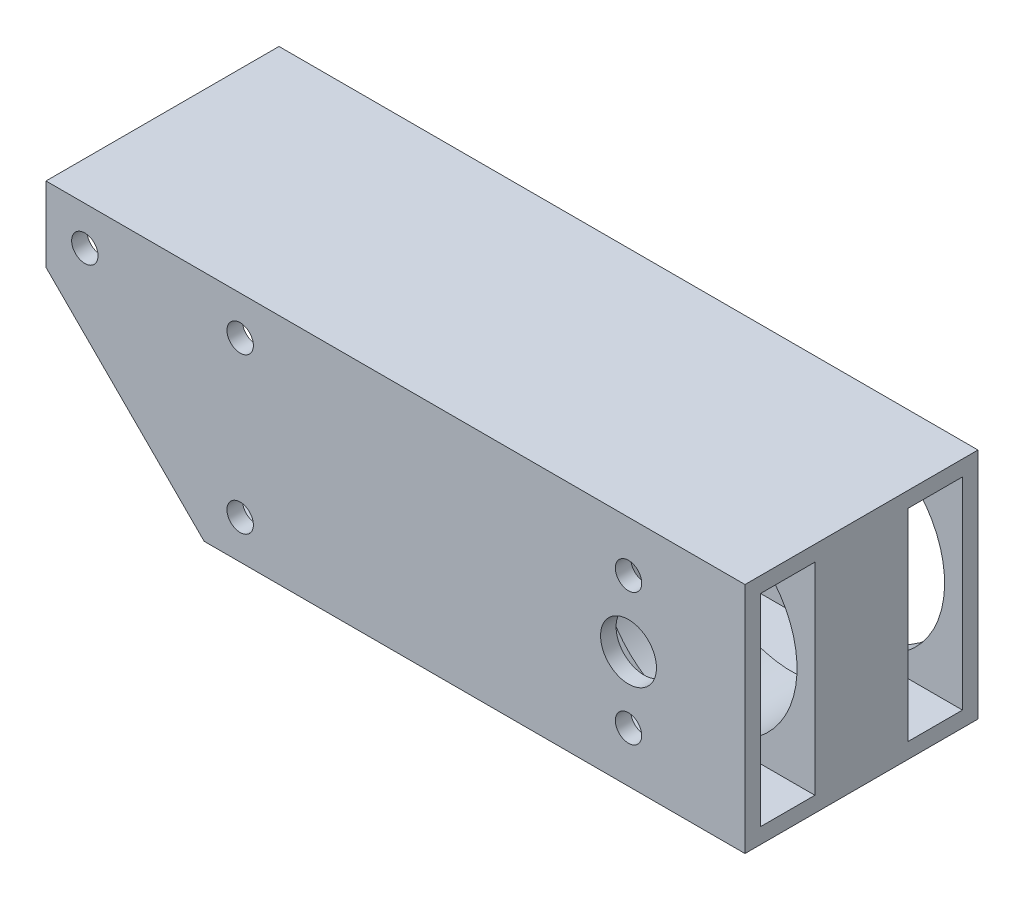
ISO-10303-21;
HEADER;
FILE_DESCRIPTION(('STEP AP214'),'2;1');
FILE_NAME('part.step','',(''),(''),'','','');
FILE_SCHEMA(('AUTOMOTIVE_DESIGN { 1 0 10303 214 1 1 1 1 }'));
ENDSEC;
DATA;
#1=APPLICATION_CONTEXT('core data for automotive mechanical design processes');
#2=APPLICATION_PROTOCOL_DEFINITION('international standard','automotive_design',2000,#1);
#3=PRODUCT_CONTEXT('',#1,'mechanical');
#4=PRODUCT('Part','Part','',(#3));
#5=PRODUCT_RELATED_PRODUCT_CATEGORY('part','',(#4));
#6=PRODUCT_DEFINITION_FORMATION('','',#4);
#7=PRODUCT_DEFINITION_CONTEXT('part definition',#1,'design');
#8=PRODUCT_DEFINITION('design','',#6,#7);
#9=PRODUCT_DEFINITION_SHAPE('','',#8);
#10=(LENGTH_UNIT() NAMED_UNIT(*) SI_UNIT(.MILLI.,.METRE.));
#11=(NAMED_UNIT(*) PLANE_ANGLE_UNIT() SI_UNIT($,.RADIAN.));
#12=(NAMED_UNIT(*) SI_UNIT($,.STERADIAN.) SOLID_ANGLE_UNIT());
#13=UNCERTAINTY_MEASURE_WITH_UNIT(LENGTH_MEASURE(1.E-05),#10,'distance_accuracy_value','');
#14=(GEOMETRIC_REPRESENTATION_CONTEXT(3) GLOBAL_UNCERTAINTY_ASSIGNED_CONTEXT((#13)) GLOBAL_UNIT_ASSIGNED_CONTEXT((#10,
#11,#12)) REPRESENTATION_CONTEXT('',''));
#15=CARTESIAN_POINT('',(0.,0.,0.));
#16=DIRECTION('',(0.,0.,1.));
#17=DIRECTION('',(1.,0.,0.));
#18=AXIS2_PLACEMENT_3D('',#15,#16,#17);
#19=CARTESIAN_POINT('',(90.,13.,6.));
#20=DIRECTION('',(0.,0.,1.));
#21=DIRECTION('',(0.,-1.,0.));
#22=AXIS2_PLACEMENT_3D('',#19,#20,#21);
#23=PLANE('',#22);
#24=CARTESIAN_POINT('',(75.,0.,6.));
#25=DIRECTION('',(0.,0.,1.));
#26=DIRECTION('',(0.,-1.,0.));
#27=AXIS2_PLACEMENT_3D('',#24,#25,#26);
#28=CIRCLE('',#27,12.7);
#29=CARTESIAN_POINT('',(75.,-12.7,6.));
#30=VERTEX_POINT('',#29);
#31=EDGE_CURVE('E285',#30,#30,#28,.T.);
#32=ORIENTED_EDGE('',*,*,#31,.F.);
#33=EDGE_LOOP('',(#32));
#34=FACE_BOUND('',#33,.T.);
#35=DIRECTION('',(-1.,0.,0.));
#36=VECTOR('',#35,1.);
#37=CARTESIAN_POINT('',(90.,13.,6.));
#38=LINE('',#37,#36);
#39=CARTESIAN_POINT('',(90.,13.,6.));
#40=VERTEX_POINT('',#39);
#41=CARTESIAN_POINT('',(59.,13.,6.));
#42=VERTEX_POINT('',#41);
#43=EDGE_CURVE('E343',#40,#42,#38,.T.);
#44=ORIENTED_EDGE('',*,*,#43,.T.);
#45=DIRECTION('',(0.,1.,0.));
#46=VECTOR('',#45,1.);
#47=CARTESIAN_POINT('',(59.,13.,6.));
#48=LINE('',#47,#46);
#49=CARTESIAN_POINT('',(59.,-13.,6.));
#50=VERTEX_POINT('',#49);
#51=EDGE_CURVE('E262',#50,#42,#48,.T.);
#52=ORIENTED_EDGE('',*,*,#51,.F.);
#53=DIRECTION('',(-1.,0.,0.));
#54=VECTOR('',#53,1.);
#55=CARTESIAN_POINT('',(90.,-13.,6.));
#56=LINE('',#55,#54);
#57=CARTESIAN_POINT('',(90.,-13.,6.));
#58=VERTEX_POINT('',#57);
#59=EDGE_CURVE('E347',#58,#50,#56,.T.);
#60=ORIENTED_EDGE('',*,*,#59,.F.);
#61=DIRECTION('',(0.,1.,0.));
#62=VECTOR('',#61,1.);
#63=CARTESIAN_POINT('',(90.,13.,6.));
#64=LINE('',#63,#62);
#65=EDGE_CURVE('E328',#58,#40,#64,.T.);
#66=ORIENTED_EDGE('',*,*,#65,.T.);
#67=EDGE_LOOP('',(#44,#52,#60,#66));
#68=FACE_BOUND('',#67,.T.);
#69=ADVANCED_FACE('F45',(#34,#68),#23,.T.);
#70=CARTESIAN_POINT('',(90.,13.,-6.));
#71=DIRECTION('',(0.,0.,-1.));
#72=DIRECTION('',(0.,1.,0.));
#73=AXIS2_PLACEMENT_3D('',#70,#71,#72);
#74=PLANE('',#73);
#75=CARTESIAN_POINT('',(75.,0.,-6.));
#76=DIRECTION('',(0.,0.,-1.));
#77=DIRECTION('',(0.,1.,0.));
#78=AXIS2_PLACEMENT_3D('',#75,#76,#77);
#79=CIRCLE('',#78,12.7);
#80=CARTESIAN_POINT('',(75.,12.7,-6.));
#81=VERTEX_POINT('',#80);
#82=EDGE_CURVE('E201',#81,#81,#79,.T.);
#83=ORIENTED_EDGE('',*,*,#82,.F.);
#84=EDGE_LOOP('',(#83));
#85=FACE_BOUND('',#84,.T.);
#86=DIRECTION('',(-1.,0.,0.));
#87=VECTOR('',#86,1.);
#88=CARTESIAN_POINT('',(90.,-13.,-6.));
#89=LINE('',#88,#87);
#90=CARTESIAN_POINT('',(90.,-13.,-6.));
#91=VERTEX_POINT('',#90);
#92=CARTESIAN_POINT('',(59.,-13.,-6.));
#93=VERTEX_POINT('',#92);
#94=EDGE_CURVE('E309',#91,#93,#89,.T.);
#95=ORIENTED_EDGE('',*,*,#94,.T.);
#96=DIRECTION('',(0.,-1.,0.));
#97=VECTOR('',#96,1.);
#98=CARTESIAN_POINT('',(59.,13.,-6.));
#99=LINE('',#98,#97);
#100=CARTESIAN_POINT('',(59.,13.,-6.));
#101=VERTEX_POINT('',#100);
#102=EDGE_CURVE('E68',#101,#93,#99,.T.);
#103=ORIENTED_EDGE('',*,*,#102,.F.);
#104=DIRECTION('',(-1.,0.,0.));
#105=VECTOR('',#104,1.);
#106=CARTESIAN_POINT('',(90.,13.,-6.));
#107=LINE('',#106,#105);
#108=CARTESIAN_POINT('',(90.,13.,-6.));
#109=VERTEX_POINT('',#108);
#110=EDGE_CURVE('E313',#109,#101,#107,.T.);
#111=ORIENTED_EDGE('',*,*,#110,.F.);
#112=DIRECTION('',(0.,-1.,0.));
#113=VECTOR('',#112,1.);
#114=CARTESIAN_POINT('',(90.,13.,-6.));
#115=LINE('',#114,#113);
#116=EDGE_CURVE('E296',#109,#91,#115,.T.);
#117=ORIENTED_EDGE('',*,*,#116,.T.);
#118=EDGE_LOOP('',(#95,#103,#111,#117));
#119=FACE_BOUND('',#118,.T.);
#120=ADVANCED_FACE('F439',(#85,#119),#74,.T.);
#121=CARTESIAN_POINT('',(90.,0.,0.));
#122=DIRECTION('',(-1.,0.,0.));
#123=DIRECTION('',(0.,0.,1.));
#124=AXIS2_PLACEMENT_3D('',#121,#122,#123);
#125=PLANE('',#124);
#126=DIRECTION('',(0.,-1.,0.));
#127=VECTOR('',#126,1.);
#128=CARTESIAN_POINT('',(90.,13.,13.));
#129=LINE('',#128,#127);
#130=CARTESIAN_POINT('',(90.,13.,13.));
#131=VERTEX_POINT('',#130);
#132=CARTESIAN_POINT('',(90.,-13.,13.));
#133=VERTEX_POINT('',#132);
#134=EDGE_CURVE('E321',#131,#133,#129,.T.);
#135=ORIENTED_EDGE('',*,*,#134,.F.);
#136=DIRECTION('',(0.,0.,1.));
#137=VECTOR('',#136,1.);
#138=CARTESIAN_POINT('',(90.,13.,13.));
#139=LINE('',#138,#137);
#140=EDGE_CURVE('E332',#40,#131,#139,.T.);
#141=ORIENTED_EDGE('',*,*,#140,.F.);
#142=ORIENTED_EDGE('',*,*,#65,.F.);
#143=DIRECTION('',(0.,0.,-1.));
#144=VECTOR('',#143,1.);
#145=CARTESIAN_POINT('',(90.,-13.,13.));
#146=LINE('',#145,#144);
#147=EDGE_CURVE('E324',#133,#58,#146,.T.);
#148=ORIENTED_EDGE('',*,*,#147,.F.);
#149=EDGE_LOOP('',(#135,#141,#142,#148));
#150=FACE_BOUND('',#149,.T.);
#151=DIRECTION('',(0.,1.,0.));
#152=VECTOR('',#151,1.);
#153=CARTESIAN_POINT('',(90.,-15.,-15.));
#154=LINE('',#153,#152);
#155=CARTESIAN_POINT('',(90.,-15.,-15.));
#156=VERTEX_POINT('',#155);
#157=CARTESIAN_POINT('',(90.,15.,-15.));
#158=VERTEX_POINT('',#157);
#159=EDGE_CURVE('E176',#156,#158,#154,.T.);
#160=ORIENTED_EDGE('',*,*,#159,.T.);
#161=DIRECTION('',(0.,0.,1.));
#162=VECTOR('',#161,1.);
#163=CARTESIAN_POINT('',(90.,15.,15.));
#164=LINE('',#163,#162);
#165=CARTESIAN_POINT('',(90.,15.,15.));
#166=VERTEX_POINT('',#165);
#167=EDGE_CURVE('E182',#158,#166,#164,.T.);
#168=ORIENTED_EDGE('',*,*,#167,.T.);
#169=DIRECTION('',(0.,-1.,0.));
#170=VECTOR('',#169,1.);
#171=CARTESIAN_POINT('',(90.,-15.,15.));
#172=LINE('',#171,#170);
#173=CARTESIAN_POINT('',(90.,-15.,15.));
#174=VERTEX_POINT('',#173);
#175=EDGE_CURVE('E357',#166,#174,#172,.T.);
#176=ORIENTED_EDGE('',*,*,#175,.T.);
#177=DIRECTION('',(0.,0.,-1.));
#178=VECTOR('',#177,1.);
#179=CARTESIAN_POINT('',(90.,-15.,15.));
#180=LINE('',#179,#178);
#181=EDGE_CURVE('E193',#174,#156,#180,.T.);
#182=ORIENTED_EDGE('',*,*,#181,.T.);
#183=EDGE_LOOP('',(#160,#168,#176,#182));
#184=FACE_BOUND('',#183,.T.);
#185=DIRECTION('',(0.,1.,0.));
#186=VECTOR('',#185,1.);
#187=CARTESIAN_POINT('',(90.,13.,-13.));
#188=LINE('',#187,#186);
#189=CARTESIAN_POINT('',(90.,-13.,-13.));
#190=VERTEX_POINT('',#189);
#191=CARTESIAN_POINT('',(90.,13.,-13.));
#192=VERTEX_POINT('',#191);
#193=EDGE_CURVE('E290',#190,#192,#188,.T.);
#194=ORIENTED_EDGE('',*,*,#193,.F.);
#195=DIRECTION('',(0.,0.,-1.));
#196=VECTOR('',#195,1.);
#197=CARTESIAN_POINT('',(90.,-13.,-13.));
#198=LINE('',#197,#196);
#199=EDGE_CURVE('E300',#91,#190,#198,.T.);
#200=ORIENTED_EDGE('',*,*,#199,.F.);
#201=ORIENTED_EDGE('',*,*,#116,.F.);
#202=DIRECTION('',(0.,0.,1.));
#203=VECTOR('',#202,1.);
#204=CARTESIAN_POINT('',(90.,13.,-13.));
#205=LINE('',#204,#203);
#206=EDGE_CURVE('E293',#192,#109,#205,.T.);
#207=ORIENTED_EDGE('',*,*,#206,.F.);
#208=EDGE_LOOP('',(#194,#200,#201,#207));
#209=FACE_BOUND('',#208,.T.);
#210=ADVANCED_FACE('F371',(#150,#184,#209),#125,.F.);
#211=CARTESIAN_POINT('',(0.,0.,0.));
#212=DIRECTION('',(-1.,0.,0.));
#213=DIRECTION('',(0.,0.,1.));
#214=AXIS2_PLACEMENT_3D('',#211,#212,#213);
#215=PLANE('',#214);
#216=DIRECTION('',(0.,0.,-1.));
#217=VECTOR('',#216,1.);
#218=CARTESIAN_POINT('',(0.,5.36467529817268,28.));
#219=LINE('',#218,#217);
#220=CARTESIAN_POINT('',(0.,5.36467529817268,15.));
#221=VERTEX_POINT('',#220);
#222=CARTESIAN_POINT('',(0.,5.36467529817268,13.));
#223=VERTEX_POINT('',#222);
#224=EDGE_CURVE('E147',#221,#223,#219,.T.);
#225=ORIENTED_EDGE('',*,*,#224,.F.);
#226=DIRECTION('',(0.,-1.,0.));
#227=VECTOR('',#226,1.);
#228=CARTESIAN_POINT('',(0.,-15.,15.));
#229=LINE('',#228,#227);
#230=CARTESIAN_POINT('',(0.,15.,15.));
#231=VERTEX_POINT('',#230);
#232=EDGE_CURVE('E164',#231,#221,#229,.T.);
#233=ORIENTED_EDGE('',*,*,#232,.F.);
#234=DIRECTION('',(0.,0.,1.));
#235=VECTOR('',#234,1.);
#236=CARTESIAN_POINT('',(0.,15.,15.));
#237=LINE('',#236,#235);
#238=CARTESIAN_POINT('',(0.,15.,-15.));
#239=VERTEX_POINT('',#238);
#240=EDGE_CURVE('E177',#239,#231,#237,.T.);
#241=ORIENTED_EDGE('',*,*,#240,.F.);
#242=DIRECTION('',(0.,1.,0.));
#243=VECTOR('',#242,1.);
#244=CARTESIAN_POINT('',(0.,-15.,-15.));
#245=LINE('',#244,#243);
#246=CARTESIAN_POINT('',(0.,5.36467529817268,-15.));
#247=VERTEX_POINT('',#246);
#248=EDGE_CURVE('E184',#247,#239,#245,.T.);
#249=ORIENTED_EDGE('',*,*,#248,.F.);
#250=CARTESIAN_POINT('',(0.,5.36467529817268,-13.));
#251=VERTEX_POINT('',#250);
#252=EDGE_CURVE('E168',#251,#247,#219,.T.);
#253=ORIENTED_EDGE('',*,*,#252,.F.);
#254=DIRECTION('',(0.,1.,0.));
#255=VECTOR('',#254,1.);
#256=CARTESIAN_POINT('',(0.,13.,-13.));
#257=LINE('',#256,#255);
#258=CARTESIAN_POINT('',(0.,13.,-13.));
#259=VERTEX_POINT('',#258);
#260=EDGE_CURVE('E289',#251,#259,#257,.T.);
#261=ORIENTED_EDGE('',*,*,#260,.T.);
#262=DIRECTION('',(0.,0.,1.));
#263=VECTOR('',#262,1.);
#264=CARTESIAN_POINT('',(0.,13.,13.));
#265=LINE('',#264,#263);
#266=CARTESIAN_POINT('',(0.,13.,13.));
#267=VERTEX_POINT('',#266);
#268=EDGE_CURVE('E325',#259,#267,#265,.T.);
#269=ORIENTED_EDGE('',*,*,#268,.T.);
#270=DIRECTION('',(0.,-1.,0.));
#271=VECTOR('',#270,1.);
#272=CARTESIAN_POINT('',(0.,13.,13.));
#273=LINE('',#272,#271);
#274=EDGE_CURVE('E166',#267,#223,#273,.T.);
#275=ORIENTED_EDGE('',*,*,#274,.T.);
#276=EDGE_LOOP('',(#225,#233,#241,#249,#253,#261,#269,#275));
#277=FACE_BOUND('',#276,.T.);
#278=ADVANCED_FACE('F162',(#277),#215,.T.);
#279=CARTESIAN_POINT('',(90.,-15.,-15.));
#280=DIRECTION('',(0.,0.,1.));
#281=DIRECTION('',(1.,0.,0.));
#282=AXIS2_PLACEMENT_3D('',#279,#280,#281);
#283=PLANE('',#282);
#284=CARTESIAN_POINT('',(25.,-10.,-15.));
#285=DIRECTION('',(0.,0.,1.));
#286=DIRECTION('',(1.,0.,0.));
#287=AXIS2_PLACEMENT_3D('',#284,#285,#286);
#288=CIRCLE('',#287,1.69999999999999);
#289=CARTESIAN_POINT('',(26.7,-10.,-15.));
#290=VERTEX_POINT('',#289);
#291=EDGE_CURVE('E391',#290,#290,#288,.T.);
#292=ORIENTED_EDGE('',*,*,#291,.T.);
#293=EDGE_LOOP('',(#292));
#294=FACE_BOUND('',#293,.T.);
#295=CARTESIAN_POINT('',(5.,10.,-15.));
#296=DIRECTION('',(0.,0.,1.));
#297=DIRECTION('',(1.,0.,0.));
#298=AXIS2_PLACEMENT_3D('',#295,#296,#297);
#299=CIRCLE('',#298,1.69999999999999);
#300=CARTESIAN_POINT('',(6.7,10.,-15.));
#301=VERTEX_POINT('',#300);
#302=EDGE_CURVE('E229',#301,#301,#299,.T.);
#303=ORIENTED_EDGE('',*,*,#302,.T.);
#304=EDGE_LOOP('',(#303));
#305=FACE_BOUND('',#304,.T.);
#306=CARTESIAN_POINT('',(25.,10.,-15.));
#307=DIRECTION('',(0.,0.,1.));
#308=DIRECTION('',(1.,0.,0.));
#309=AXIS2_PLACEMENT_3D('',#306,#307,#308);
#310=CIRCLE('',#309,1.69999999999999);
#311=CARTESIAN_POINT('',(26.7,10.,-15.));
#312=VERTEX_POINT('',#311);
#313=EDGE_CURVE('E224',#312,#312,#310,.T.);
#314=ORIENTED_EDGE('',*,*,#313,.T.);
#315=EDGE_LOOP('',(#314));
#316=FACE_BOUND('',#315,.T.);
#317=CARTESIAN_POINT('',(75.,0.,-15.));
#318=DIRECTION('',(0.,0.,-1.));
#319=DIRECTION('',(-1.,0.,0.));
#320=AXIS2_PLACEMENT_3D('',#317,#318,#319);
#321=CIRCLE('',#320,12.7);
#322=CARTESIAN_POINT('',(62.3,0.,-15.));
#323=VERTEX_POINT('',#322);
#324=EDGE_CURVE('E206',#323,#323,#321,.T.);
#325=ORIENTED_EDGE('',*,*,#324,.F.);
#326=EDGE_LOOP('',(#325));
#327=FACE_BOUND('',#326,.T.);
#328=DIRECTION('',(-1.,0.,0.));
#329=VECTOR('',#328,1.);
#330=CARTESIAN_POINT('',(90.,-15.,-15.));
#331=LINE('',#330,#329);
#332=CARTESIAN_POINT('',(20.3646752981724,-15.,-15.));
#333=VERTEX_POINT('',#332);
#334=EDGE_CURVE('E188',#156,#333,#331,.T.);
#335=ORIENTED_EDGE('',*,*,#334,.T.);
#336=DIRECTION('',(-0.707106781186543,0.707106781186552,0.));
#337=VECTOR('',#336,1.);
#338=CARTESIAN_POINT('',(55.1823376490858,-49.8176623509138,-15.));
#339=LINE('',#338,#337);
#340=EDGE_CURVE('E156',#333,#247,#339,.T.);
#341=ORIENTED_EDGE('',*,*,#340,.T.);
#342=ORIENTED_EDGE('',*,*,#248,.T.);
#343=DIRECTION('',(-1.,0.,0.));
#344=VECTOR('',#343,1.);
#345=CARTESIAN_POINT('',(90.,15.,-15.));
#346=LINE('',#345,#344);
#347=EDGE_CURVE('E54',#158,#239,#346,.T.);
#348=ORIENTED_EDGE('',*,*,#347,.F.);
#349=ORIENTED_EDGE('',*,*,#159,.F.);
#350=EDGE_LOOP('',(#335,#341,#342,#348,#349));
#351=FACE_BOUND('',#350,.T.);
#352=ADVANCED_FACE('F47',(#294,#305,#316,#327,#351),#283,.F.);
#353=CARTESIAN_POINT('',(90.,15.,15.));
#354=DIRECTION('',(0.,-1.,0.));
#355=DIRECTION('',(0.,0.,-1.));
#356=AXIS2_PLACEMENT_3D('',#353,#354,#355);
#357=PLANE('',#356);
#358=ORIENTED_EDGE('',*,*,#240,.T.);
#359=DIRECTION('',(-1.,0.,0.));
#360=VECTOR('',#359,1.);
#361=CARTESIAN_POINT('',(90.,15.,15.));
#362=LINE('',#361,#360);
#363=EDGE_CURVE('E174',#166,#231,#362,.T.);
#364=ORIENTED_EDGE('',*,*,#363,.F.);
#365=ORIENTED_EDGE('',*,*,#167,.F.);
#366=ORIENTED_EDGE('',*,*,#347,.T.);
#367=EDGE_LOOP('',(#358,#364,#365,#366));
#368=FACE_BOUND('',#367,.T.);
#369=ADVANCED_FACE('F369',(#368),#357,.F.);
#370=CARTESIAN_POINT('',(90.,-15.,15.));
#371=DIRECTION('',(0.,0.,-1.));
#372=DIRECTION('',(-1.,0.,0.));
#373=AXIS2_PLACEMENT_3D('',#370,#371,#372);
#374=PLANE('',#373);
#375=CARTESIAN_POINT('',(25.,-10.,15.));
#376=DIRECTION('',(0.,0.,1.));
#377=DIRECTION('',(1.,0.,0.));
#378=AXIS2_PLACEMENT_3D('',#375,#376,#377);
#379=CIRCLE('',#378,1.69999999999999);
#380=CARTESIAN_POINT('',(26.7,-10.,15.));
#381=VERTEX_POINT('',#380);
#382=EDGE_CURVE('E387',#381,#381,#379,.T.);
#383=ORIENTED_EDGE('',*,*,#382,.F.);
#384=EDGE_LOOP('',(#383));
#385=FACE_BOUND('',#384,.T.);
#386=CARTESIAN_POINT('',(5.,10.,15.));
#387=DIRECTION('',(0.,0.,1.));
#388=DIRECTION('',(1.,0.,0.));
#389=AXIS2_PLACEMENT_3D('',#386,#387,#388);
#390=CIRCLE('',#389,1.69999999999999);
#391=CARTESIAN_POINT('',(6.69999999999999,10.,15.));
#392=VERTEX_POINT('',#391);
#393=EDGE_CURVE('E238',#392,#392,#390,.T.);
#394=ORIENTED_EDGE('',*,*,#393,.F.);
#395=EDGE_LOOP('',(#394));
#396=FACE_BOUND('',#395,.T.);
#397=CARTESIAN_POINT('',(25.,10.,15.));
#398=DIRECTION('',(0.,0.,1.));
#399=DIRECTION('',(1.,0.,0.));
#400=AXIS2_PLACEMENT_3D('',#397,#398,#399);
#401=CIRCLE('',#400,1.69999999999999);
#402=CARTESIAN_POINT('',(26.7,10.,15.));
#403=VERTEX_POINT('',#402);
#404=EDGE_CURVE('E235',#403,#403,#401,.T.);
#405=ORIENTED_EDGE('',*,*,#404,.F.);
#406=EDGE_LOOP('',(#405));
#407=FACE_BOUND('',#406,.T.);
#408=CARTESIAN_POINT('',(75.,-8.5,15.));
#409=DIRECTION('',(0.,0.,1.));
#410=DIRECTION('',(1.,0.,0.));
#411=AXIS2_PLACEMENT_3D('',#408,#409,#410);
#412=CIRCLE('',#411,1.7);
#413=CARTESIAN_POINT('',(76.7,-8.5,15.));
#414=VERTEX_POINT('',#413);
#415=EDGE_CURVE('E268',#414,#414,#412,.T.);
#416=ORIENTED_EDGE('',*,*,#415,.F.);
#417=EDGE_LOOP('',(#416));
#418=FACE_BOUND('',#417,.T.);
#419=CARTESIAN_POINT('',(75.,8.5,15.));
#420=DIRECTION('',(0.,0.,1.));
#421=DIRECTION('',(1.,0.,0.));
#422=AXIS2_PLACEMENT_3D('',#419,#420,#421);
#423=CIRCLE('',#422,1.7);
#424=CARTESIAN_POINT('',(76.7,8.5,15.));
#425=VERTEX_POINT('',#424);
#426=EDGE_CURVE('E269',#425,#425,#423,.T.);
#427=ORIENTED_EDGE('',*,*,#426,.F.);
#428=EDGE_LOOP('',(#427));
#429=FACE_BOUND('',#428,.T.);
#430=CARTESIAN_POINT('',(75.,0.,15.));
#431=DIRECTION('',(0.,0.,1.));
#432=DIRECTION('',(1.,0.,0.));
#433=AXIS2_PLACEMENT_3D('',#430,#431,#432);
#434=CIRCLE('',#433,3.6);
#435=CARTESIAN_POINT('',(78.6,0.,15.));
#436=VERTEX_POINT('',#435);
#437=EDGE_CURVE('E212',#436,#436,#434,.T.);
#438=ORIENTED_EDGE('',*,*,#437,.F.);
#439=EDGE_LOOP('',(#438));
#440=FACE_BOUND('',#439,.T.);
#441=ORIENTED_EDGE('',*,*,#232,.T.);
#442=DIRECTION('',(0.707106781186543,-0.707106781186552,0.));
#443=VECTOR('',#442,1.);
#444=CARTESIAN_POINT('',(55.1823376490858,-49.8176623509138,15.));
#445=LINE('',#444,#443);
#446=CARTESIAN_POINT('',(20.3646752981724,-15.,15.));
#447=VERTEX_POINT('',#446);
#448=EDGE_CURVE('E144',#221,#447,#445,.T.);
#449=ORIENTED_EDGE('',*,*,#448,.T.);
#450=DIRECTION('',(-1.,0.,0.));
#451=VECTOR('',#450,1.);
#452=CARTESIAN_POINT('',(90.,-15.,15.));
#453=LINE('',#452,#451);
#454=EDGE_CURVE('E192',#174,#447,#453,.T.);
#455=ORIENTED_EDGE('',*,*,#454,.F.);
#456=ORIENTED_EDGE('',*,*,#175,.F.);
#457=ORIENTED_EDGE('',*,*,#363,.T.);
#458=EDGE_LOOP('',(#441,#449,#455,#456,#457));
#459=FACE_BOUND('',#458,.T.);
#460=ADVANCED_FACE('F171',(#385,#396,#407,#418,#429,#440,#459),#374,.F.);
#461=CARTESIAN_POINT('',(90.,-15.,15.));
#462=DIRECTION('',(0.,1.,0.));
#463=DIRECTION('',(0.,0.,1.));
#464=AXIS2_PLACEMENT_3D('',#461,#462,#463);
#465=PLANE('',#464);
#466=ORIENTED_EDGE('',*,*,#454,.T.);
#467=DIRECTION('',(0.,0.,-1.));
#468=VECTOR('',#467,1.);
#469=CARTESIAN_POINT('',(20.3646752981724,-15.,28.));
#470=LINE('',#469,#468);
#471=EDGE_CURVE('E150',#447,#333,#470,.T.);
#472=ORIENTED_EDGE('',*,*,#471,.T.);
#473=ORIENTED_EDGE('',*,*,#334,.F.);
#474=ORIENTED_EDGE('',*,*,#181,.F.);
#475=EDGE_LOOP('',(#466,#472,#473,#474));
#476=FACE_BOUND('',#475,.T.);
#477=ADVANCED_FACE('F376',(#476),#465,.F.);
#478=CARTESIAN_POINT('',(90.,13.,13.));
#479=DIRECTION('',(0.,0.,-1.));
#480=DIRECTION('',(0.,1.,0.));
#481=AXIS2_PLACEMENT_3D('',#478,#479,#480);
#482=PLANE('',#481);
#483=DIRECTION('',(0.707106781186543,-0.707106781186552,0.));
#484=VECTOR('',#483,1.);
#485=CARTESIAN_POINT('',(41.1823376490858,-35.8176623509136,13.));
#486=LINE('',#485,#484);
#487=CARTESIAN_POINT('',(18.3646752981724,-13.,13.));
#488=VERTEX_POINT('',#487);
#489=EDGE_CURVE('E157',#223,#488,#486,.T.);
#490=ORIENTED_EDGE('',*,*,#489,.F.);
#491=ORIENTED_EDGE('',*,*,#274,.F.);
#492=DIRECTION('',(-1.,0.,0.));
#493=VECTOR('',#492,1.);
#494=CARTESIAN_POINT('',(90.,13.,13.));
#495=LINE('',#494,#493);
#496=EDGE_CURVE('E335',#131,#267,#495,.T.);
#497=ORIENTED_EDGE('',*,*,#496,.F.);
#498=ORIENTED_EDGE('',*,*,#134,.T.);
#499=DIRECTION('',(-1.,0.,0.));
#500=VECTOR('',#499,1.);
#501=CARTESIAN_POINT('',(90.,-13.,13.));
#502=LINE('',#501,#500);
#503=EDGE_CURVE('E351',#133,#488,#502,.T.);
#504=ORIENTED_EDGE('',*,*,#503,.T.);
#505=EDGE_LOOP('',(#490,#491,#497,#498,#504));
#506=FACE_BOUND('',#505,.T.);
#507=CARTESIAN_POINT('',(25.,-10.,13.));
#508=DIRECTION('',(0.,0.,-1.));
#509=DIRECTION('',(0.,1.,0.));
#510=AXIS2_PLACEMENT_3D('',#507,#508,#509);
#511=CIRCLE('',#510,1.69999999999999);
#512=CARTESIAN_POINT('',(25.,-8.30000000000001,13.));
#513=VERTEX_POINT('',#512);
#514=EDGE_CURVE('E244',#513,#513,#511,.T.);
#515=ORIENTED_EDGE('',*,*,#514,.F.);
#516=EDGE_LOOP('',(#515));
#517=FACE_BOUND('',#516,.T.);
#518=CARTESIAN_POINT('',(5.,10.,13.));
#519=DIRECTION('',(0.,0.,-1.));
#520=DIRECTION('',(0.,1.,0.));
#521=AXIS2_PLACEMENT_3D('',#518,#519,#520);
#522=CIRCLE('',#521,1.69999999999999);
#523=CARTESIAN_POINT('',(5.,11.7,13.));
#524=VERTEX_POINT('',#523);
#525=EDGE_CURVE('E225',#524,#524,#522,.T.);
#526=ORIENTED_EDGE('',*,*,#525,.F.);
#527=EDGE_LOOP('',(#526));
#528=FACE_BOUND('',#527,.T.);
#529=CARTESIAN_POINT('',(25.,10.,13.));
#530=DIRECTION('',(0.,0.,-1.));
#531=DIRECTION('',(0.,1.,0.));
#532=AXIS2_PLACEMENT_3D('',#529,#530,#531);
#533=CIRCLE('',#532,1.69999999999999);
#534=CARTESIAN_POINT('',(25.,11.7,13.));
#535=VERTEX_POINT('',#534);
#536=EDGE_CURVE('E223',#535,#535,#533,.T.);
#537=ORIENTED_EDGE('',*,*,#536,.F.);
#538=EDGE_LOOP('',(#537));
#539=FACE_BOUND('',#538,.T.);
#540=CARTESIAN_POINT('',(75.,-8.5,13.));
#541=DIRECTION('',(0.,0.,-1.));
#542=DIRECTION('',(0.,1.,0.));
#543=AXIS2_PLACEMENT_3D('',#540,#541,#542);
#544=CIRCLE('',#543,1.7);
#545=CARTESIAN_POINT('',(75.,-6.8,13.));
#546=VERTEX_POINT('',#545);
#547=EDGE_CURVE('E216',#546,#546,#544,.T.);
#548=ORIENTED_EDGE('',*,*,#547,.F.);
#549=EDGE_LOOP('',(#548));
#550=FACE_BOUND('',#549,.T.);
#551=CARTESIAN_POINT('',(75.,8.5,13.));
#552=DIRECTION('',(0.,0.,-1.));
#553=DIRECTION('',(0.,1.,0.));
#554=AXIS2_PLACEMENT_3D('',#551,#552,#553);
#555=CIRCLE('',#554,1.7);
#556=CARTESIAN_POINT('',(75.,10.2,13.));
#557=VERTEX_POINT('',#556);
#558=EDGE_CURVE('E211',#557,#557,#555,.T.);
#559=ORIENTED_EDGE('',*,*,#558,.F.);
#560=EDGE_LOOP('',(#559));
#561=FACE_BOUND('',#560,.T.);
#562=CARTESIAN_POINT('',(75.,0.,13.));
#563=DIRECTION('',(0.,0.,-1.));
#564=DIRECTION('',(0.,1.,0.));
#565=AXIS2_PLACEMENT_3D('',#562,#563,#564);
#566=CIRCLE('',#565,3.6);
#567=CARTESIAN_POINT('',(75.,3.6,13.));
#568=VERTEX_POINT('',#567);
#569=EDGE_CURVE('E207',#568,#568,#566,.T.);
#570=ORIENTED_EDGE('',*,*,#569,.F.);
#571=EDGE_LOOP('',(#570));
#572=FACE_BOUND('',#571,.T.);
#573=ADVANCED_FACE('F405',(#506,#517,#528,#539,#550,#561,#572),#482,.T.);
#574=CARTESIAN_POINT('',(90.,-13.,13.));
#575=DIRECTION('',(0.,1.,0.));
#576=DIRECTION('',(0.,0.,1.));
#577=AXIS2_PLACEMENT_3D('',#574,#575,#576);
#578=PLANE('',#577);
#579=DIRECTION('',(0.,0.,-1.));
#580=VECTOR('',#579,1.);
#581=CARTESIAN_POINT('',(18.3646752981724,-13.,13.));
#582=LINE('',#581,#580);
#583=CARTESIAN_POINT('',(18.3646752981725,-13.,-13.));
#584=VERTEX_POINT('',#583);
#585=EDGE_CURVE('E60',#488,#584,#582,.T.);
#586=ORIENTED_EDGE('',*,*,#585,.F.);
#587=ORIENTED_EDGE('',*,*,#503,.F.);
#588=ORIENTED_EDGE('',*,*,#147,.T.);
#589=ORIENTED_EDGE('',*,*,#59,.T.);
#590=DIRECTION('',(0.,0.,1.));
#591=VECTOR('',#590,1.);
#592=CARTESIAN_POINT('',(59.,-13.,-6.));
#593=LINE('',#592,#591);
#594=EDGE_CURVE('E259',#93,#50,#593,.T.);
#595=ORIENTED_EDGE('',*,*,#594,.F.);
#596=ORIENTED_EDGE('',*,*,#94,.F.);
#597=ORIENTED_EDGE('',*,*,#199,.T.);
#598=DIRECTION('',(-1.,0.,0.));
#599=VECTOR('',#598,1.);
#600=CARTESIAN_POINT('',(90.,-13.,-13.));
#601=LINE('',#600,#599);
#602=EDGE_CURVE('E303',#190,#584,#601,.T.);
#603=ORIENTED_EDGE('',*,*,#602,.T.);
#604=EDGE_LOOP('',(#586,#587,#588,#589,#595,#596,#597,#603));
#605=FACE_BOUND('',#604,.T.);
#606=ADVANCED_FACE('F408',(#605),#578,.T.);
#607=CARTESIAN_POINT('',(90.,13.,13.));
#608=DIRECTION('',(0.,-1.,0.));
#609=DIRECTION('',(0.,0.,-1.));
#610=AXIS2_PLACEMENT_3D('',#607,#608,#609);
#611=PLANE('',#610);
#612=ORIENTED_EDGE('',*,*,#268,.F.);
#613=DIRECTION('',(-1.,0.,0.));
#614=VECTOR('',#613,1.);
#615=CARTESIAN_POINT('',(90.,13.,-13.));
#616=LINE('',#615,#614);
#617=EDGE_CURVE('E317',#192,#259,#616,.T.);
#618=ORIENTED_EDGE('',*,*,#617,.F.);
#619=ORIENTED_EDGE('',*,*,#206,.T.);
#620=ORIENTED_EDGE('',*,*,#110,.T.);
#621=DIRECTION('',(0.,0.,-1.));
#622=VECTOR('',#621,1.);
#623=CARTESIAN_POINT('',(59.,13.,-6.));
#624=LINE('',#623,#622);
#625=EDGE_CURVE('E265',#42,#101,#624,.T.);
#626=ORIENTED_EDGE('',*,*,#625,.F.);
#627=ORIENTED_EDGE('',*,*,#43,.F.);
#628=ORIENTED_EDGE('',*,*,#140,.T.);
#629=ORIENTED_EDGE('',*,*,#496,.T.);
#630=EDGE_LOOP('',(#612,#618,#619,#620,#626,#627,#628,#629));
#631=FACE_BOUND('',#630,.T.);
#632=ADVANCED_FACE('F453',(#631),#611,.T.);
#633=CARTESIAN_POINT('',(90.,13.,-13.));
#634=DIRECTION('',(0.,0.,1.));
#635=DIRECTION('',(0.,-1.,0.));
#636=AXIS2_PLACEMENT_3D('',#633,#634,#635);
#637=PLANE('',#636);
#638=DIRECTION('',(-0.707106781186543,0.707106781186552,0.));
#639=VECTOR('',#638,1.);
#640=CARTESIAN_POINT('',(41.1823376490858,-35.8176623509136,-13.));
#641=LINE('',#640,#639);
#642=EDGE_CURVE('E11',#584,#251,#641,.T.);
#643=ORIENTED_EDGE('',*,*,#642,.F.);
#644=ORIENTED_EDGE('',*,*,#602,.F.);
#645=ORIENTED_EDGE('',*,*,#193,.T.);
#646=ORIENTED_EDGE('',*,*,#617,.T.);
#647=ORIENTED_EDGE('',*,*,#260,.F.);
#648=EDGE_LOOP('',(#643,#644,#645,#646,#647));
#649=FACE_BOUND('',#648,.T.);
#650=CARTESIAN_POINT('',(25.,-10.,-13.));
#651=DIRECTION('',(0.,0.,1.));
#652=DIRECTION('',(0.,-1.,0.));
#653=AXIS2_PLACEMENT_3D('',#650,#651,#652);
#654=CIRCLE('',#653,1.69999999999999);
#655=CARTESIAN_POINT('',(25.,-11.7,-13.));
#656=VERTEX_POINT('',#655);
#657=EDGE_CURVE('E395',#656,#656,#654,.T.);
#658=ORIENTED_EDGE('',*,*,#657,.F.);
#659=EDGE_LOOP('',(#658));
#660=FACE_BOUND('',#659,.T.);
#661=CARTESIAN_POINT('',(5.,10.,-13.));
#662=DIRECTION('',(0.,0.,1.));
#663=DIRECTION('',(0.,-1.,0.));
#664=AXIS2_PLACEMENT_3D('',#661,#662,#663);
#665=CIRCLE('',#664,1.69999999999999);
#666=CARTESIAN_POINT('',(5.,8.30000000000001,-13.));
#667=VERTEX_POINT('',#666);
#668=EDGE_CURVE('E228',#667,#667,#665,.T.);
#669=ORIENTED_EDGE('',*,*,#668,.F.);
#670=EDGE_LOOP('',(#669));
#671=FACE_BOUND('',#670,.T.);
#672=CARTESIAN_POINT('',(25.,10.,-13.));
#673=DIRECTION('',(0.,0.,1.));
#674=DIRECTION('',(0.,-1.,0.));
#675=AXIS2_PLACEMENT_3D('',#672,#673,#674);
#676=CIRCLE('',#675,1.69999999999999);
#677=CARTESIAN_POINT('',(25.,8.30000000000001,-13.));
#678=VERTEX_POINT('',#677);
#679=EDGE_CURVE('E220',#678,#678,#676,.T.);
#680=ORIENTED_EDGE('',*,*,#679,.F.);
#681=EDGE_LOOP('',(#680));
#682=FACE_BOUND('',#681,.T.);
#683=CARTESIAN_POINT('',(75.,0.,-13.));
#684=DIRECTION('',(0.,0.,1.));
#685=DIRECTION('',(0.,-1.,0.));
#686=AXIS2_PLACEMENT_3D('',#683,#684,#685);
#687=CIRCLE('',#686,12.7);
#688=CARTESIAN_POINT('',(75.,-12.7,-13.));
#689=VERTEX_POINT('',#688);
#690=EDGE_CURVE('E205',#689,#689,#687,.T.);
#691=ORIENTED_EDGE('',*,*,#690,.F.);
#692=EDGE_LOOP('',(#691));
#693=FACE_BOUND('',#692,.T.);
#694=ADVANCED_FACE('F481',(#649,#660,#671,#682,#693),#637,.T.);
#695=CARTESIAN_POINT('',(75.,0.,8.00000000000004));
#696=DIRECTION('',(0.,0.,-1.));
#697=DIRECTION('',(-1.,0.,0.));
#698=AXIS2_PLACEMENT_3D('',#695,#696,#697);
#699=CYLINDRICAL_SURFACE('',#698,12.7);
#700=ORIENTED_EDGE('',*,*,#31,.T.);
#701=EDGE_LOOP('',(#700));
#702=FACE_BOUND('',#701,.T.);
#703=ORIENTED_EDGE('',*,*,#82,.T.);
#704=EDGE_LOOP('',(#703));
#705=FACE_BOUND('',#704,.T.);
#706=ADVANCED_FACE('F475',(#702,#705),#699,.F.);
#707=ORIENTED_EDGE('',*,*,#690,.T.);
#708=EDGE_LOOP('',(#707));
#709=FACE_BOUND('',#708,.T.);
#710=ORIENTED_EDGE('',*,*,#324,.T.);
#711=EDGE_LOOP('',(#710));
#712=FACE_BOUND('',#711,.T.);
#713=ADVANCED_FACE('F424',(#709,#712),#699,.F.);
#714=CARTESIAN_POINT('',(75.,0.,-2.00000000000003));
#715=DIRECTION('',(0.,0.,1.));
#716=DIRECTION('',(1.,0.,0.));
#717=AXIS2_PLACEMENT_3D('',#714,#715,#716);
#718=CYLINDRICAL_SURFACE('',#717,3.6);
#719=ORIENTED_EDGE('',*,*,#569,.T.);
#720=EDGE_LOOP('',(#719));
#721=FACE_BOUND('',#720,.T.);
#722=ORIENTED_EDGE('',*,*,#437,.T.);
#723=EDGE_LOOP('',(#722));
#724=FACE_BOUND('',#723,.T.);
#725=ADVANCED_FACE('F420',(#721,#724),#718,.F.);
#726=CARTESIAN_POINT('',(75.,8.5,-2.00000000000003));
#727=DIRECTION('',(0.,0.,1.));
#728=DIRECTION('',(1.,0.,0.));
#729=AXIS2_PLACEMENT_3D('',#726,#727,#728);
#730=CYLINDRICAL_SURFACE('',#729,1.7);
#731=ORIENTED_EDGE('',*,*,#558,.T.);
#732=EDGE_LOOP('',(#731));
#733=FACE_BOUND('',#732,.T.);
#734=ORIENTED_EDGE('',*,*,#426,.T.);
#735=EDGE_LOOP('',(#734));
#736=FACE_BOUND('',#735,.T.);
#737=ADVANCED_FACE('F423',(#733,#736),#730,.F.);
#738=CARTESIAN_POINT('',(75.,-8.5,-2.00000000000003));
#739=DIRECTION('',(0.,0.,1.));
#740=DIRECTION('',(1.,0.,0.));
#741=AXIS2_PLACEMENT_3D('',#738,#739,#740);
#742=CYLINDRICAL_SURFACE('',#741,1.7);
#743=ORIENTED_EDGE('',*,*,#547,.T.);
#744=EDGE_LOOP('',(#743));
#745=FACE_BOUND('',#744,.T.);
#746=ORIENTED_EDGE('',*,*,#415,.T.);
#747=EDGE_LOOP('',(#746));
#748=FACE_BOUND('',#747,.T.);
#749=ADVANCED_FACE('F513',(#745,#748),#742,.F.);
#750=CARTESIAN_POINT('',(59.,0.,0.));
#751=DIRECTION('',(-1.,0.,0.));
#752=DIRECTION('',(0.,0.,1.));
#753=AXIS2_PLACEMENT_3D('',#750,#751,#752);
#754=PLANE('',#753);
#755=ORIENTED_EDGE('',*,*,#102,.T.);
#756=ORIENTED_EDGE('',*,*,#594,.T.);
#757=ORIENTED_EDGE('',*,*,#51,.T.);
#758=ORIENTED_EDGE('',*,*,#625,.T.);
#759=EDGE_LOOP('',(#755,#756,#757,#758));
#760=FACE_BOUND('',#759,.T.);
#761=ADVANCED_FACE('F505',(#760),#754,.T.);
#762=CARTESIAN_POINT('',(25.,10.,15.));
#763=DIRECTION('',(0.,0.,1.));
#764=DIRECTION('',(1.,0.,0.));
#765=AXIS2_PLACEMENT_3D('',#762,#763,#764);
#766=CYLINDRICAL_SURFACE('',#765,1.69999999999999);
#767=ORIENTED_EDGE('',*,*,#679,.T.);
#768=EDGE_LOOP('',(#767));
#769=FACE_BOUND('',#768,.T.);
#770=ORIENTED_EDGE('',*,*,#313,.F.);
#771=EDGE_LOOP('',(#770));
#772=FACE_BOUND('',#771,.T.);
#773=ADVANCED_FACE('F501',(#769,#772),#766,.F.);
#774=ORIENTED_EDGE('',*,*,#536,.T.);
#775=EDGE_LOOP('',(#774));
#776=FACE_BOUND('',#775,.T.);
#777=ORIENTED_EDGE('',*,*,#404,.T.);
#778=EDGE_LOOP('',(#777));
#779=FACE_BOUND('',#778,.T.);
#780=ADVANCED_FACE('F504',(#776,#779),#766,.F.);
#781=CARTESIAN_POINT('',(5.,10.,15.));
#782=DIRECTION('',(0.,0.,1.));
#783=DIRECTION('',(1.,0.,0.));
#784=AXIS2_PLACEMENT_3D('',#781,#782,#783);
#785=CYLINDRICAL_SURFACE('',#784,1.69999999999999);
#786=ORIENTED_EDGE('',*,*,#525,.T.);
#787=EDGE_LOOP('',(#786));
#788=FACE_BOUND('',#787,.T.);
#789=ORIENTED_EDGE('',*,*,#393,.T.);
#790=EDGE_LOOP('',(#789));
#791=FACE_BOUND('',#790,.T.);
#792=ADVANCED_FACE('F510',(#788,#791),#785,.F.);
#793=ORIENTED_EDGE('',*,*,#668,.T.);
#794=EDGE_LOOP('',(#793));
#795=FACE_BOUND('',#794,.T.);
#796=ORIENTED_EDGE('',*,*,#302,.F.);
#797=EDGE_LOOP('',(#796));
#798=FACE_BOUND('',#797,.T.);
#799=ADVANCED_FACE('F539',(#795,#798),#785,.F.);
#800=CARTESIAN_POINT('',(25.,-10.,15.));
#801=DIRECTION('',(0.,0.,1.));
#802=DIRECTION('',(1.,0.,0.));
#803=AXIS2_PLACEMENT_3D('',#800,#801,#802);
#804=CYLINDRICAL_SURFACE('',#803,1.69999999999999);
#805=ORIENTED_EDGE('',*,*,#514,.T.);
#806=EDGE_LOOP('',(#805));
#807=FACE_BOUND('',#806,.T.);
#808=ORIENTED_EDGE('',*,*,#382,.T.);
#809=EDGE_LOOP('',(#808));
#810=FACE_BOUND('',#809,.T.);
#811=ADVANCED_FACE('F402',(#807,#810),#804,.F.);
#812=ORIENTED_EDGE('',*,*,#657,.T.);
#813=EDGE_LOOP('',(#812));
#814=FACE_BOUND('',#813,.T.);
#815=ORIENTED_EDGE('',*,*,#291,.F.);
#816=EDGE_LOOP('',(#815));
#817=FACE_BOUND('',#816,.T.);
#818=ADVANCED_FACE('F553',(#814,#817),#804,.F.);
#819=CARTESIAN_POINT('',(2.68233764908634,2.68233764908631,28.));
#820=DIRECTION('',(0.707106781186552,0.707106781186543,0.));
#821=DIRECTION('',(-0.707106781186543,0.707106781186552,0.));
#822=AXIS2_PLACEMENT_3D('',#819,#820,#821);
#823=PLANE('',#822);
#824=ORIENTED_EDGE('',*,*,#471,.F.);
#825=ORIENTED_EDGE('',*,*,#448,.F.);
#826=ORIENTED_EDGE('',*,*,#224,.T.);
#827=ORIENTED_EDGE('',*,*,#489,.T.);
#828=ORIENTED_EDGE('',*,*,#585,.T.);
#829=ORIENTED_EDGE('',*,*,#642,.T.);
#830=ORIENTED_EDGE('',*,*,#252,.T.);
#831=ORIENTED_EDGE('',*,*,#340,.F.);
#832=EDGE_LOOP('',(#824,#825,#826,#827,#828,#829,#830,#831));
#833=FACE_BOUND('',#832,.T.);
#834=ADVANCED_FACE('F146',(#833),#823,.F.);
#835=CLOSED_SHELL('',(#69,#120,#210,#278,#352,#369,#460,#477,#573,#606,#632,#694,#706,#713,#725,
#737,#749,#761,#773,#780,#792,#799,#811,#818,#834));
#836=MANIFOLD_SOLID_BREP('B2',#835);
#837=ADVANCED_BREP_SHAPE_REPRESENTATION('',(#18,#836),#14);
#838=SHAPE_DEFINITION_REPRESENTATION(#9,#837);
ENDSEC;
END-ISO-10303-21;
